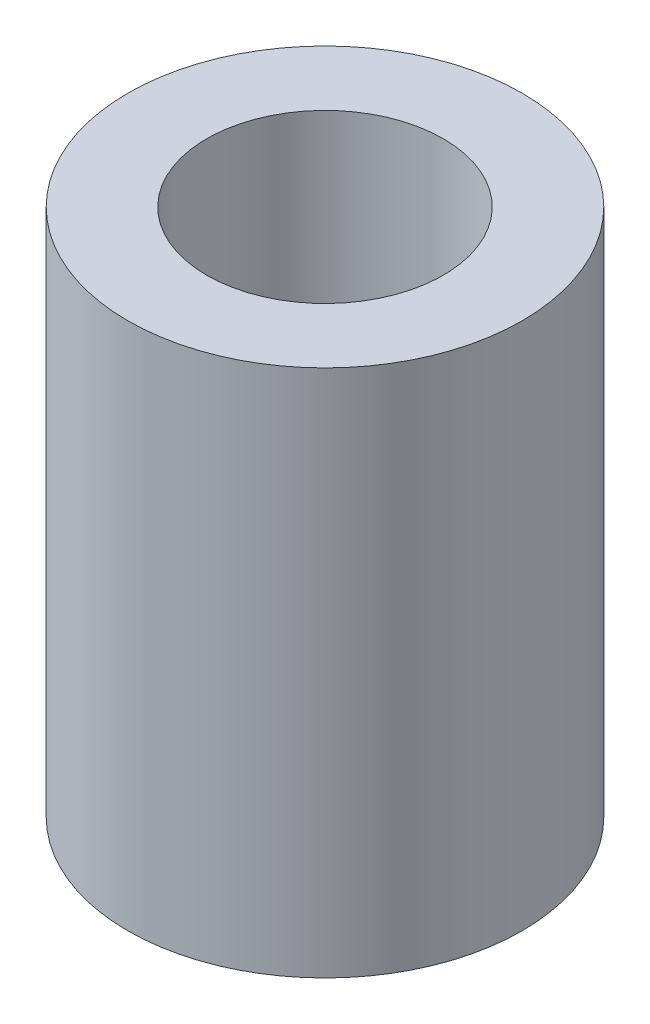
ISO-10303-21;
HEADER;
FILE_DESCRIPTION(('STEP AP214'),'2;1');
FILE_NAME('part.step','',(''),(''),'','','');
FILE_SCHEMA(('AUTOMOTIVE_DESIGN { 1 0 10303 214 1 1 1 1 }'));
ENDSEC;
DATA;
#1=APPLICATION_CONTEXT('core data for automotive mechanical design processes');
#2=APPLICATION_PROTOCOL_DEFINITION('international standard','automotive_design',2000,#1);
#3=PRODUCT_CONTEXT('',#1,'mechanical');
#4=PRODUCT('Part','Part','',(#3));
#5=PRODUCT_RELATED_PRODUCT_CATEGORY('part','',(#4));
#6=PRODUCT_DEFINITION_FORMATION('','',#4);
#7=PRODUCT_DEFINITION_CONTEXT('part definition',#1,'design');
#8=PRODUCT_DEFINITION('design','',#6,#7);
#9=PRODUCT_DEFINITION_SHAPE('','',#8);
#10=(LENGTH_UNIT() NAMED_UNIT(*) SI_UNIT(.MILLI.,.METRE.));
#11=(NAMED_UNIT(*) PLANE_ANGLE_UNIT() SI_UNIT($,.RADIAN.));
#12=(NAMED_UNIT(*) SI_UNIT($,.STERADIAN.) SOLID_ANGLE_UNIT());
#13=UNCERTAINTY_MEASURE_WITH_UNIT(LENGTH_MEASURE(1.E-05),#10,'distance_accuracy_value','');
#14=(GEOMETRIC_REPRESENTATION_CONTEXT(3) GLOBAL_UNCERTAINTY_ASSIGNED_CONTEXT((#13)) GLOBAL_UNIT_ASSIGNED_CONTEXT((#10,
#11,#12)) REPRESENTATION_CONTEXT('',''));
#15=CARTESIAN_POINT('',(0.,0.,0.));
#16=DIRECTION('',(0.,0.,1.));
#17=DIRECTION('',(1.,0.,0.));
#18=AXIS2_PLACEMENT_3D('',#15,#16,#17);
#19=CARTESIAN_POINT('',(0.,6.7,0.));
#20=DIRECTION('',(0.,1.,0.));
#21=DIRECTION('',(0.,0.,1.));
#22=AXIS2_PLACEMENT_3D('',#19,#20,#21);
#23=PLANE('',#22);
#24=CARTESIAN_POINT('',(0.,6.7,0.));
#25=DIRECTION('',(0.,1.,0.));
#26=DIRECTION('',(0.,0.,1.));
#27=AXIS2_PLACEMENT_3D('',#24,#25,#26);
#28=CIRCLE('',#27,2.5);
#29=CARTESIAN_POINT('',(0.,6.7,2.5));
#30=VERTEX_POINT('',#29);
#31=EDGE_CURVE('E10',#30,#30,#28,.T.);
#32=ORIENTED_EDGE('',*,*,#31,.T.);
#33=EDGE_LOOP('',(#32));
#34=FACE_BOUND('',#33,.T.);
#35=CARTESIAN_POINT('',(0.,6.7,0.));
#36=DIRECTION('',(0.,1.,0.));
#37=DIRECTION('',(0.,0.,1.));
#38=AXIS2_PLACEMENT_3D('',#35,#36,#37);
#39=CIRCLE('',#38,1.5);
#40=CARTESIAN_POINT('',(0.,6.7,1.5));
#41=VERTEX_POINT('',#40);
#42=EDGE_CURVE('E42',#41,#41,#39,.T.);
#43=ORIENTED_EDGE('',*,*,#42,.F.);
#44=EDGE_LOOP('',(#43));
#45=FACE_BOUND('',#44,.T.);
#46=ADVANCED_FACE('F31',(#34,#45),#23,.T.);
#47=CARTESIAN_POINT('',(0.,0.,0.));
#48=DIRECTION('',(0.,1.,0.));
#49=DIRECTION('',(0.,0.,1.));
#50=AXIS2_PLACEMENT_3D('',#47,#48,#49);
#51=PLANE('',#50);
#52=CARTESIAN_POINT('',(0.,0.,0.));
#53=DIRECTION('',(0.,1.,0.));
#54=DIRECTION('',(0.,0.,1.));
#55=AXIS2_PLACEMENT_3D('',#52,#53,#54);
#56=CIRCLE('',#55,2.5);
#57=CARTESIAN_POINT('',(0.,0.,2.5));
#58=VERTEX_POINT('',#57);
#59=EDGE_CURVE('E35',#58,#58,#56,.T.);
#60=ORIENTED_EDGE('',*,*,#59,.F.);
#61=EDGE_LOOP('',(#60));
#62=FACE_BOUND('',#61,.T.);
#63=CARTESIAN_POINT('',(0.,0.,0.));
#64=DIRECTION('',(0.,1.,0.));
#65=DIRECTION('',(0.,0.,1.));
#66=AXIS2_PLACEMENT_3D('',#63,#64,#65);
#67=CIRCLE('',#66,1.5);
#68=CARTESIAN_POINT('',(0.,0.,1.5));
#69=VERTEX_POINT('',#68);
#70=EDGE_CURVE('E44',#69,#69,#67,.T.);
#71=ORIENTED_EDGE('',*,*,#70,.T.);
#72=EDGE_LOOP('',(#71));
#73=FACE_BOUND('',#72,.T.);
#74=ADVANCED_FACE('F54',(#62,#73),#51,.F.);
#75=CARTESIAN_POINT('',(0.,6.7,0.));
#76=DIRECTION('',(0.,-1.,0.));
#77=DIRECTION('',(0.,0.,-1.));
#78=AXIS2_PLACEMENT_3D('',#75,#76,#77);
#79=CYLINDRICAL_SURFACE('',#78,2.5);
#80=ORIENTED_EDGE('',*,*,#31,.F.);
#81=EDGE_LOOP('',(#80));
#82=FACE_BOUND('',#81,.T.);
#83=ORIENTED_EDGE('',*,*,#59,.T.);
#84=EDGE_LOOP('',(#83));
#85=FACE_BOUND('',#84,.T.);
#86=ADVANCED_FACE('F33',(#82,#85),#79,.T.);
#87=CARTESIAN_POINT('',(0.,6.7,0.));
#88=DIRECTION('',(0.,-1.,0.));
#89=DIRECTION('',(0.,0.,-1.));
#90=AXIS2_PLACEMENT_3D('',#87,#88,#89);
#91=CYLINDRICAL_SURFACE('',#90,1.5);
#92=ORIENTED_EDGE('',*,*,#42,.T.);
#93=EDGE_LOOP('',(#92));
#94=FACE_BOUND('',#93,.T.);
#95=ORIENTED_EDGE('',*,*,#70,.F.);
#96=EDGE_LOOP('',(#95));
#97=FACE_BOUND('',#96,.T.);
#98=ADVANCED_FACE('F50',(#94,#97),#91,.F.);
#99=CLOSED_SHELL('',(#46,#74,#86,#98));
#100=MANIFOLD_SOLID_BREP('B2',#99);
#101=ADVANCED_BREP_SHAPE_REPRESENTATION('',(#18,#100),#14);
#102=SHAPE_DEFINITION_REPRESENTATION(#9,#101);
ENDSEC;
END-ISO-10303-21;
